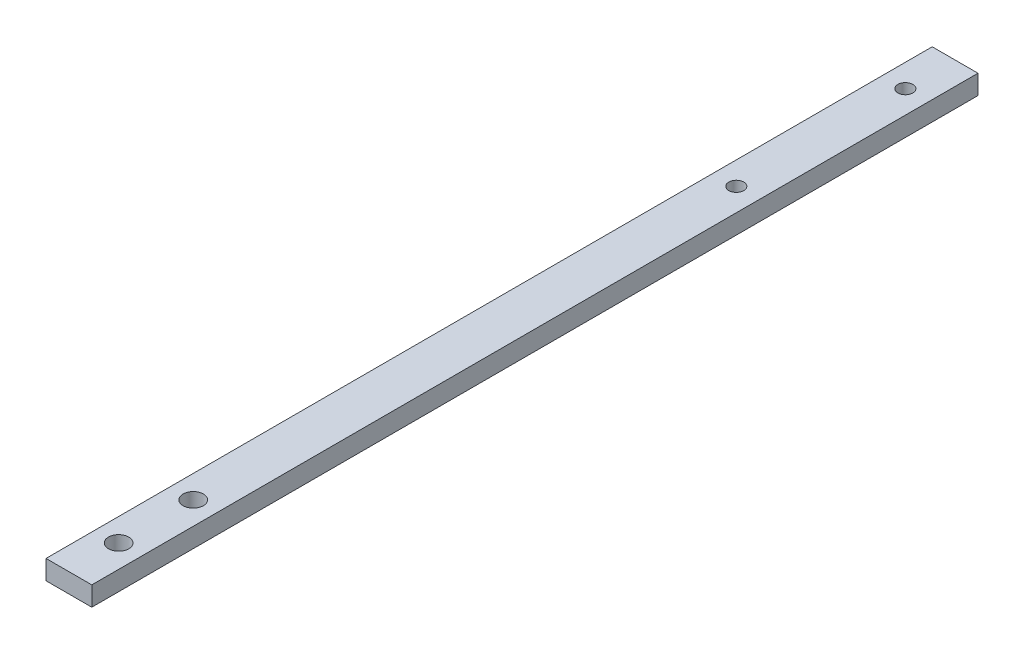
ISO-10303-21;
HEADER;
FILE_DESCRIPTION(('STEP AP214'),'2;1');
FILE_NAME('part.step','',(''),(''),'','','');
FILE_SCHEMA(('AUTOMOTIVE_DESIGN { 1 0 10303 214 1 1 1 1 }'));
ENDSEC;
DATA;
#1=APPLICATION_CONTEXT('core data for automotive mechanical design processes');
#2=APPLICATION_PROTOCOL_DEFINITION('international standard','automotive_design',2000,#1);
#3=PRODUCT_CONTEXT('',#1,'mechanical');
#4=PRODUCT('Part','Part','',(#3));
#5=PRODUCT_RELATED_PRODUCT_CATEGORY('part','',(#4));
#6=PRODUCT_DEFINITION_FORMATION('','',#4);
#7=PRODUCT_DEFINITION_CONTEXT('part definition',#1,'design');
#8=PRODUCT_DEFINITION('design','',#6,#7);
#9=PRODUCT_DEFINITION_SHAPE('','',#8);
#10=(LENGTH_UNIT() NAMED_UNIT(*) SI_UNIT(.MILLI.,.METRE.));
#11=(NAMED_UNIT(*) PLANE_ANGLE_UNIT() SI_UNIT($,.RADIAN.));
#12=(NAMED_UNIT(*) SI_UNIT($,.STERADIAN.) SOLID_ANGLE_UNIT());
#13=UNCERTAINTY_MEASURE_WITH_UNIT(LENGTH_MEASURE(1.E-05),#10,'distance_accuracy_value','');
#14=(GEOMETRIC_REPRESENTATION_CONTEXT(3) GLOBAL_UNCERTAINTY_ASSIGNED_CONTEXT((#13)) GLOBAL_UNIT_ASSIGNED_CONTEXT((#10,
#11,#12)) REPRESENTATION_CONTEXT('',''));
#15=CARTESIAN_POINT('',(0.,0.,0.));
#16=DIRECTION('',(0.,0.,1.));
#17=DIRECTION('',(1.,0.,0.));
#18=AXIS2_PLACEMENT_3D('',#15,#16,#17);
#19=CARTESIAN_POINT('',(-2.30241812767133,-0.974099977091898,89.1));
#20=DIRECTION('',(1.,0.,0.));
#21=DIRECTION('',(0.,0.,-1.));
#22=AXIS2_PLACEMENT_3D('',#19,#20,#21);
#23=PLANE('',#22);
#24=DIRECTION('',(0.,0.,-1.));
#25=VECTOR('',#24,1.);
#26=CARTESIAN_POINT('',(-2.30241812767133,0.974099977091898,89.1));
#27=LINE('',#26,#25);
#28=CARTESIAN_POINT('',(-2.30241812767133,0.974099977091898,89.1));
#29=VERTEX_POINT('',#28);
#30=CARTESIAN_POINT('',(-2.30241812767133,0.974099977091898,0.));
#31=VERTEX_POINT('',#30);
#32=EDGE_CURVE('E86',#29,#31,#27,.T.);
#33=ORIENTED_EDGE('',*,*,#32,.T.);
#34=DIRECTION('',(0.,-1.,0.));
#35=VECTOR('',#34,1.);
#36=CARTESIAN_POINT('',(-2.30241812767133,0.974099977091898,0.));
#37=LINE('',#36,#35);
#38=CARTESIAN_POINT('',(-2.30241812767133,-0.974099977091898,0.));
#39=VERTEX_POINT('',#38);
#40=EDGE_CURVE('E96',#31,#39,#37,.T.);
#41=ORIENTED_EDGE('',*,*,#40,.T.);
#42=DIRECTION('',(0.,0.,-1.));
#43=VECTOR('',#42,1.);
#44=CARTESIAN_POINT('',(-2.30241812767133,-0.974099977091898,89.1));
#45=LINE('',#44,#43);
#46=CARTESIAN_POINT('',(-2.30241812767133,-0.974099977091898,89.1));
#47=VERTEX_POINT('',#46);
#48=EDGE_CURVE('E12',#47,#39,#45,.T.);
#49=ORIENTED_EDGE('',*,*,#48,.F.);
#50=DIRECTION('',(0.,-1.,0.));
#51=VECTOR('',#50,1.);
#52=CARTESIAN_POINT('',(-2.30241812767133,-0.974099977091898,89.1));
#53=LINE('',#52,#51);
#54=EDGE_CURVE('E120',#29,#47,#53,.T.);
#55=ORIENTED_EDGE('',*,*,#54,.F.);
#56=EDGE_LOOP('',(#33,#41,#49,#55));
#57=FACE_BOUND('',#56,.T.);
#58=ADVANCED_FACE('F34',(#57),#23,.F.);
#59=CARTESIAN_POINT('',(2.30241812767133,-0.974099977091898,89.1));
#60=DIRECTION('',(0.,1.,0.));
#61=DIRECTION('',(0.,0.,1.));
#62=AXIS2_PLACEMENT_3D('',#59,#60,#61);
#63=PLANE('',#62);
#64=CARTESIAN_POINT('',(0.,-0.974099977091898,84.1));
#65=DIRECTION('',(0.,1.,0.));
#66=DIRECTION('',(0.,0.,1.));
#67=AXIS2_PLACEMENT_3D('',#64,#65,#66);
#68=CIRCLE('',#67,1.02271797872274);
#69=CARTESIAN_POINT('',(0.,-0.974099977091898,85.1227179787227));
#70=VERTEX_POINT('',#69);
#71=EDGE_CURVE('E111',#70,#70,#68,.T.);
#72=ORIENTED_EDGE('',*,*,#71,.T.);
#73=EDGE_LOOP('',(#72));
#74=FACE_BOUND('',#73,.T.);
#75=CARTESIAN_POINT('',(0.,-0.974099977091898,76.6));
#76=DIRECTION('',(0.,1.,0.));
#77=DIRECTION('',(0.,0.,1.));
#78=AXIS2_PLACEMENT_3D('',#75,#76,#77);
#79=CIRCLE('',#78,1.02271797872274);
#80=CARTESIAN_POINT('',(0.,-0.974099977091898,77.6227179787228));
#81=VERTEX_POINT('',#80);
#82=EDGE_CURVE('E117',#81,#81,#79,.T.);
#83=ORIENTED_EDGE('',*,*,#82,.T.);
#84=EDGE_LOOP('',(#83));
#85=FACE_BOUND('',#84,.T.);
#86=ORIENTED_EDGE('',*,*,#48,.T.);
#87=DIRECTION('',(1.,0.,0.));
#88=VECTOR('',#87,1.);
#89=CARTESIAN_POINT('',(-2.30241812767133,-0.974099977091898,0.));
#90=LINE('',#89,#88);
#91=CARTESIAN_POINT('',(2.30241812767133,-0.974099977091898,0.));
#92=VERTEX_POINT('',#91);
#93=EDGE_CURVE('E94',#39,#92,#90,.T.);
#94=ORIENTED_EDGE('',*,*,#93,.T.);
#95=DIRECTION('',(0.,0.,-1.));
#96=VECTOR('',#95,1.);
#97=CARTESIAN_POINT('',(2.30241812767133,-0.974099977091898,89.1));
#98=LINE('',#97,#96);
#99=CARTESIAN_POINT('',(2.30241812767133,-0.974099977091898,89.1));
#100=VERTEX_POINT('',#99);
#101=EDGE_CURVE('E43',#100,#92,#98,.T.);
#102=ORIENTED_EDGE('',*,*,#101,.F.);
#103=DIRECTION('',(1.,0.,0.));
#104=VECTOR('',#103,1.);
#105=CARTESIAN_POINT('',(2.30241812767133,-0.974099977091898,89.1));
#106=LINE('',#105,#104);
#107=EDGE_CURVE('E122',#47,#100,#106,.T.);
#108=ORIENTED_EDGE('',*,*,#107,.F.);
#109=EDGE_LOOP('',(#86,#94,#102,#108));
#110=FACE_BOUND('',#109,.T.);
#111=CARTESIAN_POINT('',(0.,-0.974099977091898,22.));
#112=DIRECTION('',(0.,-1.,0.));
#113=DIRECTION('',(0.,0.,-1.));
#114=AXIS2_PLACEMENT_3D('',#111,#112,#113);
#115=CIRCLE('',#114,0.750000000000001);
#116=CARTESIAN_POINT('',(0.,-0.974099977091898,21.25));
#117=VERTEX_POINT('',#116);
#118=EDGE_CURVE('E97',#117,#117,#115,.F.);
#119=ORIENTED_EDGE('',*,*,#118,.T.);
#120=EDGE_LOOP('',(#119));
#121=FACE_BOUND('',#120,.T.);
#122=CARTESIAN_POINT('',(0.,-0.974099977091898,5.));
#123=DIRECTION('',(0.,-1.,0.));
#124=DIRECTION('',(0.,0.,-1.));
#125=AXIS2_PLACEMENT_3D('',#122,#123,#124);
#126=CIRCLE('',#125,0.75);
#127=CARTESIAN_POINT('',(0.,-0.974099977091898,4.25));
#128=VERTEX_POINT('',#127);
#129=EDGE_CURVE('E100',#128,#128,#126,.F.);
#130=ORIENTED_EDGE('',*,*,#129,.T.);
#131=EDGE_LOOP('',(#130));
#132=FACE_BOUND('',#131,.T.);
#133=ADVANCED_FACE('F131',(#74,#85,#110,#121,#132),#63,.F.);
#134=CARTESIAN_POINT('',(2.30241812767133,-0.974099977091898,89.1));
#135=DIRECTION('',(-1.,0.,0.));
#136=DIRECTION('',(0.,0.,1.));
#137=AXIS2_PLACEMENT_3D('',#134,#135,#136);
#138=PLANE('',#137);
#139=ORIENTED_EDGE('',*,*,#101,.T.);
#140=DIRECTION('',(0.,1.,0.));
#141=VECTOR('',#140,1.);
#142=CARTESIAN_POINT('',(2.30241812767133,0.974099977091898,0.));
#143=LINE('',#142,#141);
#144=CARTESIAN_POINT('',(2.30241812767133,0.974099977091898,0.));
#145=VERTEX_POINT('',#144);
#146=EDGE_CURVE('E89',#92,#145,#143,.T.);
#147=ORIENTED_EDGE('',*,*,#146,.T.);
#148=DIRECTION('',(0.,0.,-1.));
#149=VECTOR('',#148,1.);
#150=CARTESIAN_POINT('',(2.30241812767133,0.974099977091898,89.1));
#151=LINE('',#150,#149);
#152=CARTESIAN_POINT('',(2.30241812767133,0.974099977091898,89.1));
#153=VERTEX_POINT('',#152);
#154=EDGE_CURVE('E77',#153,#145,#151,.T.);
#155=ORIENTED_EDGE('',*,*,#154,.F.);
#156=DIRECTION('',(0.,1.,0.));
#157=VECTOR('',#156,1.);
#158=CARTESIAN_POINT('',(2.30241812767133,-0.974099977091898,89.1));
#159=LINE('',#158,#157);
#160=EDGE_CURVE('E124',#100,#153,#159,.T.);
#161=ORIENTED_EDGE('',*,*,#160,.F.);
#162=EDGE_LOOP('',(#139,#147,#155,#161));
#163=FACE_BOUND('',#162,.T.);
#164=ADVANCED_FACE('F90',(#163),#138,.F.);
#165=CARTESIAN_POINT('',(2.30241812767133,0.974099977091898,89.1));
#166=DIRECTION('',(0.,-1.,0.));
#167=DIRECTION('',(0.,0.,-1.));
#168=AXIS2_PLACEMENT_3D('',#165,#166,#167);
#169=PLANE('',#168);
#170=CARTESIAN_POINT('',(0.,0.974099977091898,84.1));
#171=DIRECTION('',(0.,1.,0.));
#172=DIRECTION('',(0.,0.,1.));
#173=AXIS2_PLACEMENT_3D('',#170,#171,#172);
#174=CIRCLE('',#173,1.02271797872274);
#175=CARTESIAN_POINT('',(0.,0.974099977091898,85.1227179787227));
#176=VERTEX_POINT('',#175);
#177=EDGE_CURVE('E108',#176,#176,#174,.T.);
#178=ORIENTED_EDGE('',*,*,#177,.F.);
#179=EDGE_LOOP('',(#178));
#180=FACE_BOUND('',#179,.T.);
#181=CARTESIAN_POINT('',(0.,0.974099977091898,76.6));
#182=DIRECTION('',(0.,1.,0.));
#183=DIRECTION('',(0.,0.,1.));
#184=AXIS2_PLACEMENT_3D('',#181,#182,#183);
#185=CIRCLE('',#184,1.02271797872274);
#186=CARTESIAN_POINT('',(0.,0.974099977091898,77.6227179787228));
#187=VERTEX_POINT('',#186);
#188=EDGE_CURVE('E114',#187,#187,#185,.T.);
#189=ORIENTED_EDGE('',*,*,#188,.F.);
#190=EDGE_LOOP('',(#189));
#191=FACE_BOUND('',#190,.T.);
#192=ORIENTED_EDGE('',*,*,#154,.T.);
#193=DIRECTION('',(-1.,0.,0.));
#194=VECTOR('',#193,1.);
#195=CARTESIAN_POINT('',(-2.30241812767133,0.974099977091898,0.));
#196=LINE('',#195,#194);
#197=EDGE_CURVE('E82',#145,#31,#196,.T.);
#198=ORIENTED_EDGE('',*,*,#197,.T.);
#199=ORIENTED_EDGE('',*,*,#32,.F.);
#200=DIRECTION('',(-1.,0.,0.));
#201=VECTOR('',#200,1.);
#202=CARTESIAN_POINT('',(2.30241812767133,0.974099977091898,89.1));
#203=LINE('',#202,#201);
#204=EDGE_CURVE('E57',#153,#29,#203,.T.);
#205=ORIENTED_EDGE('',*,*,#204,.F.);
#206=EDGE_LOOP('',(#192,#198,#199,#205));
#207=FACE_BOUND('',#206,.T.);
#208=CARTESIAN_POINT('',(0.,0.974099977091897,22.));
#209=DIRECTION('',(0.,1.,0.));
#210=DIRECTION('',(0.,0.,1.));
#211=AXIS2_PLACEMENT_3D('',#208,#209,#210);
#212=CIRCLE('',#211,0.750000000000001);
#213=CARTESIAN_POINT('',(0.,0.974099977091897,22.75));
#214=VERTEX_POINT('',#213);
#215=EDGE_CURVE('E38',#214,#214,#212,.F.);
#216=ORIENTED_EDGE('',*,*,#215,.T.);
#217=EDGE_LOOP('',(#216));
#218=FACE_BOUND('',#217,.T.);
#219=CARTESIAN_POINT('',(0.,0.974099977091897,5.));
#220=DIRECTION('',(0.,1.,0.));
#221=DIRECTION('',(0.,0.,1.));
#222=AXIS2_PLACEMENT_3D('',#219,#220,#221);
#223=CIRCLE('',#222,0.75);
#224=CARTESIAN_POINT('',(0.,0.974099977091897,5.75));
#225=VERTEX_POINT('',#224);
#226=EDGE_CURVE('E105',#225,#225,#223,.F.);
#227=ORIENTED_EDGE('',*,*,#226,.T.);
#228=EDGE_LOOP('',(#227));
#229=FACE_BOUND('',#228,.T.);
#230=ADVANCED_FACE('F79',(#180,#191,#207,#218,#229),#169,.F.);
#231=CARTESIAN_POINT('',(0.,0.,89.1));
#232=DIRECTION('',(0.,0.,1.));
#233=DIRECTION('',(1.,0.,0.));
#234=AXIS2_PLACEMENT_3D('',#231,#232,#233);
#235=PLANE('',#234);
#236=ORIENTED_EDGE('',*,*,#54,.T.);
#237=ORIENTED_EDGE('',*,*,#107,.T.);
#238=ORIENTED_EDGE('',*,*,#160,.T.);
#239=ORIENTED_EDGE('',*,*,#204,.T.);
#240=EDGE_LOOP('',(#236,#237,#238,#239));
#241=FACE_BOUND('',#240,.T.);
#242=ADVANCED_FACE('F130',(#241),#235,.T.);
#243=CARTESIAN_POINT('',(0.,-2.5,76.6));
#244=DIRECTION('',(0.,1.,0.));
#245=DIRECTION('',(0.,0.,1.));
#246=AXIS2_PLACEMENT_3D('',#243,#244,#245);
#247=CYLINDRICAL_SURFACE('',#246,1.02271797872274);
#248=ORIENTED_EDGE('',*,*,#188,.T.);
#249=EDGE_LOOP('',(#248));
#250=FACE_BOUND('',#249,.T.);
#251=ORIENTED_EDGE('',*,*,#82,.F.);
#252=EDGE_LOOP('',(#251));
#253=FACE_BOUND('',#252,.T.);
#254=ADVANCED_FACE('F155',(#250,#253),#247,.F.);
#255=CARTESIAN_POINT('',(0.,-2.5,84.1));
#256=DIRECTION('',(0.,1.,0.));
#257=DIRECTION('',(0.,0.,1.));
#258=AXIS2_PLACEMENT_3D('',#255,#256,#257);
#259=CYLINDRICAL_SURFACE('',#258,1.02271797872274);
#260=ORIENTED_EDGE('',*,*,#177,.T.);
#261=EDGE_LOOP('',(#260));
#262=FACE_BOUND('',#261,.T.);
#263=ORIENTED_EDGE('',*,*,#71,.F.);
#264=EDGE_LOOP('',(#263));
#265=FACE_BOUND('',#264,.T.);
#266=ADVANCED_FACE('F144',(#262,#265),#259,.F.);
#267=CARTESIAN_POINT('',(0.,-2.5,5.));
#268=DIRECTION('',(0.,1.,0.));
#269=DIRECTION('',(0.,0.,1.));
#270=AXIS2_PLACEMENT_3D('',#267,#268,#269);
#271=CYLINDRICAL_SURFACE('',#270,0.75);
#272=ORIENTED_EDGE('',*,*,#129,.F.);
#273=EDGE_LOOP('',(#272));
#274=FACE_BOUND('',#273,.T.);
#275=ORIENTED_EDGE('',*,*,#226,.F.);
#276=EDGE_LOOP('',(#275));
#277=FACE_BOUND('',#276,.T.);
#278=ADVANCED_FACE('F141',(#274,#277),#271,.F.);
#279=CARTESIAN_POINT('',(0.,0.,0.));
#280=DIRECTION('',(0.,0.,1.));
#281=DIRECTION('',(1.,0.,0.));
#282=AXIS2_PLACEMENT_3D('',#279,#280,#281);
#283=PLANE('',#282);
#284=ORIENTED_EDGE('',*,*,#40,.F.);
#285=ORIENTED_EDGE('',*,*,#197,.F.);
#286=ORIENTED_EDGE('',*,*,#146,.F.);
#287=ORIENTED_EDGE('',*,*,#93,.F.);
#288=EDGE_LOOP('',(#284,#285,#286,#287));
#289=FACE_BOUND('',#288,.T.);
#290=ADVANCED_FACE('F36',(#289),#283,.F.);
#291=CARTESIAN_POINT('',(0.,-2.5,22.));
#292=DIRECTION('',(0.,1.,0.));
#293=DIRECTION('',(0.,0.,1.));
#294=AXIS2_PLACEMENT_3D('',#291,#292,#293);
#295=CYLINDRICAL_SURFACE('',#294,0.750000000000001);
#296=ORIENTED_EDGE('',*,*,#118,.F.);
#297=EDGE_LOOP('',(#296));
#298=FACE_BOUND('',#297,.T.);
#299=ORIENTED_EDGE('',*,*,#215,.F.);
#300=EDGE_LOOP('',(#299));
#301=FACE_BOUND('',#300,.T.);
#302=ADVANCED_FACE('F195',(#298,#301),#295,.F.);
#303=CLOSED_SHELL('',(#58,#133,#164,#230,#242,#254,#266,#278,#290,#302));
#304=MANIFOLD_SOLID_BREP('B2',#303);
#305=ADVANCED_BREP_SHAPE_REPRESENTATION('',(#18,#304),#14);
#306=SHAPE_DEFINITION_REPRESENTATION(#9,#305);
ENDSEC;
END-ISO-10303-21;
